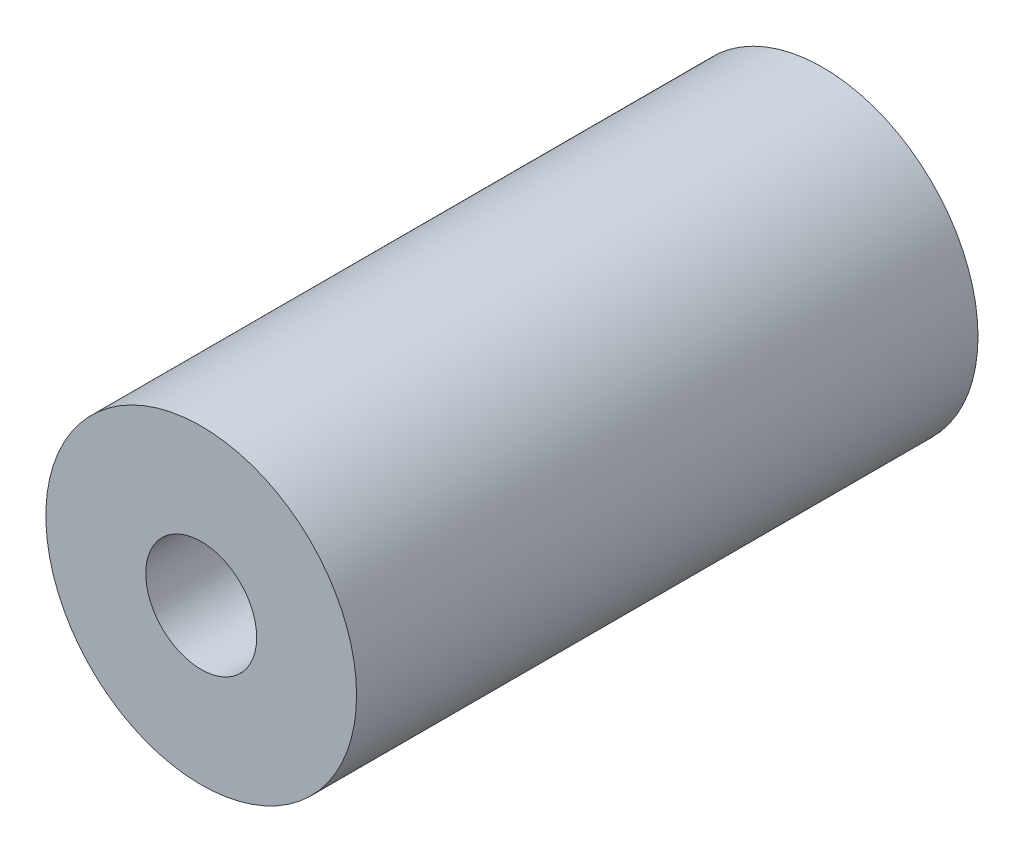
ISO-10303-21;
HEADER;
FILE_DESCRIPTION(('STEP AP214'),'2;1');
FILE_NAME('part.step','',(''),(''),'','','');
FILE_SCHEMA(('AUTOMOTIVE_DESIGN { 1 0 10303 214 1 1 1 1 }'));
ENDSEC;
DATA;
#1=APPLICATION_CONTEXT('core data for automotive mechanical design processes');
#2=APPLICATION_PROTOCOL_DEFINITION('international standard','automotive_design',2000,#1);
#3=PRODUCT_CONTEXT('',#1,'mechanical');
#4=PRODUCT('Part','Part','',(#3));
#5=PRODUCT_RELATED_PRODUCT_CATEGORY('part','',(#4));
#6=PRODUCT_DEFINITION_FORMATION('','',#4);
#7=PRODUCT_DEFINITION_CONTEXT('part definition',#1,'design');
#8=PRODUCT_DEFINITION('design','',#6,#7);
#9=PRODUCT_DEFINITION_SHAPE('','',#8);
#10=(LENGTH_UNIT() NAMED_UNIT(*) SI_UNIT(.MILLI.,.METRE.));
#11=(NAMED_UNIT(*) PLANE_ANGLE_UNIT() SI_UNIT($,.RADIAN.));
#12=(NAMED_UNIT(*) SI_UNIT($,.STERADIAN.) SOLID_ANGLE_UNIT());
#13=UNCERTAINTY_MEASURE_WITH_UNIT(LENGTH_MEASURE(1.E-05),#10,'distance_accuracy_value','');
#14=(GEOMETRIC_REPRESENTATION_CONTEXT(3) GLOBAL_UNCERTAINTY_ASSIGNED_CONTEXT((#13)) GLOBAL_UNIT_ASSIGNED_CONTEXT((#10,
#11,#12)) REPRESENTATION_CONTEXT('',''));
#15=CARTESIAN_POINT('',(0.,0.,0.));
#16=DIRECTION('',(0.,0.,1.));
#17=DIRECTION('',(1.,0.,0.));
#18=AXIS2_PLACEMENT_3D('',#15,#16,#17);
#19=CARTESIAN_POINT('',(0.,0.,9.525));
#20=DIRECTION('',(0.,0.,1.));
#21=DIRECTION('',(1.,0.,0.));
#22=AXIS2_PLACEMENT_3D('',#19,#20,#21);
#23=PLANE('',#22);
#24=CARTESIAN_POINT('',(0.,0.,9.525));
#25=DIRECTION('',(0.,0.,1.));
#26=DIRECTION('',(1.,0.,0.));
#27=AXIS2_PLACEMENT_3D('',#24,#25,#26);
#28=CIRCLE('',#27,4.7625);
#29=CARTESIAN_POINT('',(4.7625,0.,9.525));
#30=VERTEX_POINT('',#29);
#31=EDGE_CURVE('E10',#30,#30,#28,.T.);
#32=ORIENTED_EDGE('',*,*,#31,.T.);
#33=EDGE_LOOP('',(#32));
#34=FACE_BOUND('',#33,.T.);
#35=CARTESIAN_POINT('',(0.,0.,9.525));
#36=DIRECTION('',(0.,0.,1.));
#37=DIRECTION('',(1.,0.,0.));
#38=AXIS2_PLACEMENT_3D('',#35,#36,#37);
#39=CIRCLE('',#38,1.7);
#40=CARTESIAN_POINT('',(1.7,0.,9.525));
#41=VERTEX_POINT('',#40);
#42=EDGE_CURVE('E42',#41,#41,#39,.T.);
#43=ORIENTED_EDGE('',*,*,#42,.F.);
#44=EDGE_LOOP('',(#43));
#45=FACE_BOUND('',#44,.T.);
#46=ADVANCED_FACE('F31',(#34,#45),#23,.T.);
#47=CARTESIAN_POINT('',(0.,0.,-9.525));
#48=DIRECTION('',(0.,0.,1.));
#49=DIRECTION('',(1.,0.,0.));
#50=AXIS2_PLACEMENT_3D('',#47,#48,#49);
#51=PLANE('',#50);
#52=CARTESIAN_POINT('',(0.,0.,-9.525));
#53=DIRECTION('',(0.,0.,1.));
#54=DIRECTION('',(1.,0.,0.));
#55=AXIS2_PLACEMENT_3D('',#52,#53,#54);
#56=CIRCLE('',#55,4.7625);
#57=CARTESIAN_POINT('',(4.7625,0.,-9.525));
#58=VERTEX_POINT('',#57);
#59=EDGE_CURVE('E35',#58,#58,#56,.T.);
#60=ORIENTED_EDGE('',*,*,#59,.F.);
#61=EDGE_LOOP('',(#60));
#62=FACE_BOUND('',#61,.T.);
#63=CARTESIAN_POINT('',(0.,0.,-9.525));
#64=DIRECTION('',(0.,0.,1.));
#65=DIRECTION('',(1.,0.,0.));
#66=AXIS2_PLACEMENT_3D('',#63,#64,#65);
#67=CIRCLE('',#66,1.7);
#68=CARTESIAN_POINT('',(1.7,0.,-9.525));
#69=VERTEX_POINT('',#68);
#70=EDGE_CURVE('E44',#69,#69,#67,.T.);
#71=ORIENTED_EDGE('',*,*,#70,.T.);
#72=EDGE_LOOP('',(#71));
#73=FACE_BOUND('',#72,.T.);
#74=ADVANCED_FACE('F54',(#62,#73),#51,.F.);
#75=CARTESIAN_POINT('',(0.,0.,9.525));
#76=DIRECTION('',(0.,0.,-1.));
#77=DIRECTION('',(-1.,0.,0.));
#78=AXIS2_PLACEMENT_3D('',#75,#76,#77);
#79=CYLINDRICAL_SURFACE('',#78,4.7625);
#80=ORIENTED_EDGE('',*,*,#31,.F.);
#81=EDGE_LOOP('',(#80));
#82=FACE_BOUND('',#81,.T.);
#83=ORIENTED_EDGE('',*,*,#59,.T.);
#84=EDGE_LOOP('',(#83));
#85=FACE_BOUND('',#84,.T.);
#86=ADVANCED_FACE('F33',(#82,#85),#79,.T.);
#87=CARTESIAN_POINT('',(0.,0.,9.525));
#88=DIRECTION('',(0.,0.,-1.));
#89=DIRECTION('',(-1.,0.,0.));
#90=AXIS2_PLACEMENT_3D('',#87,#88,#89);
#91=CYLINDRICAL_SURFACE('',#90,1.7);
#92=ORIENTED_EDGE('',*,*,#42,.T.);
#93=EDGE_LOOP('',(#92));
#94=FACE_BOUND('',#93,.T.);
#95=ORIENTED_EDGE('',*,*,#70,.F.);
#96=EDGE_LOOP('',(#95));
#97=FACE_BOUND('',#96,.T.);
#98=ADVANCED_FACE('F50',(#94,#97),#91,.F.);
#99=CLOSED_SHELL('',(#46,#74,#86,#98));
#100=MANIFOLD_SOLID_BREP('B2',#99);
#101=ADVANCED_BREP_SHAPE_REPRESENTATION('',(#18,#100),#14);
#102=SHAPE_DEFINITION_REPRESENTATION(#9,#101);
ENDSEC;
END-ISO-10303-21;
